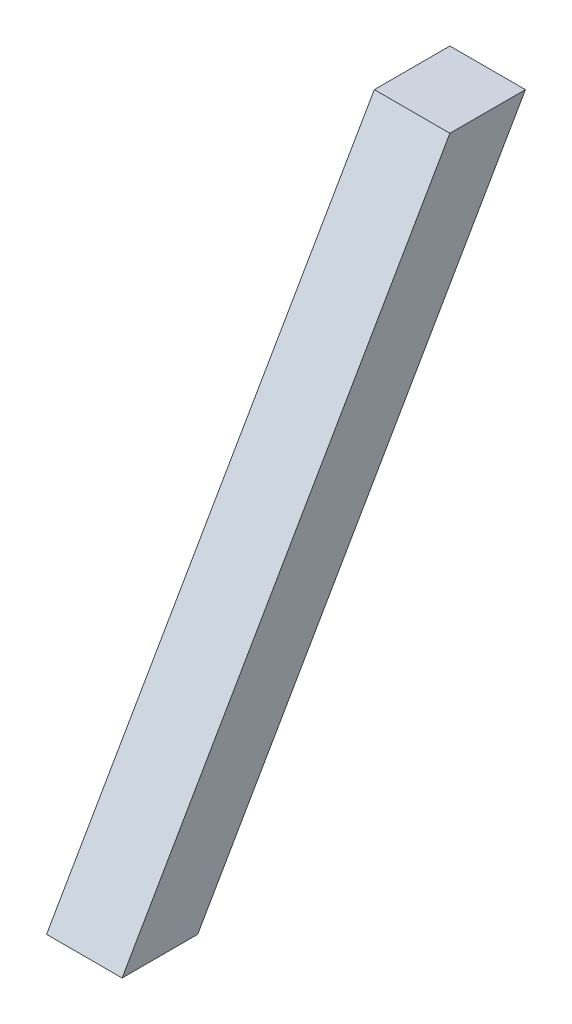
ISO-10303-21;
HEADER;
FILE_DESCRIPTION(('STEP AP214'),'2;1');
FILE_NAME('part.step','',(''),(''),'','','');
FILE_SCHEMA(('AUTOMOTIVE_DESIGN { 1 0 10303 214 1 1 1 1 }'));
ENDSEC;
DATA;
#1=APPLICATION_CONTEXT('core data for automotive mechanical design processes');
#2=APPLICATION_PROTOCOL_DEFINITION('international standard','automotive_design',2000,#1);
#3=PRODUCT_CONTEXT('',#1,'mechanical');
#4=PRODUCT('Part','Part','',(#3));
#5=PRODUCT_RELATED_PRODUCT_CATEGORY('part','',(#4));
#6=PRODUCT_DEFINITION_FORMATION('','',#4);
#7=PRODUCT_DEFINITION_CONTEXT('part definition',#1,'design');
#8=PRODUCT_DEFINITION('design','',#6,#7);
#9=PRODUCT_DEFINITION_SHAPE('','',#8);
#10=(LENGTH_UNIT() NAMED_UNIT(*) SI_UNIT(.MILLI.,.METRE.));
#11=(NAMED_UNIT(*) PLANE_ANGLE_UNIT() SI_UNIT($,.RADIAN.));
#12=(NAMED_UNIT(*) SI_UNIT($,.STERADIAN.) SOLID_ANGLE_UNIT());
#13=UNCERTAINTY_MEASURE_WITH_UNIT(LENGTH_MEASURE(1.E-05),#10,'distance_accuracy_value','');
#14=(GEOMETRIC_REPRESENTATION_CONTEXT(3) GLOBAL_UNCERTAINTY_ASSIGNED_CONTEXT((#13)) GLOBAL_UNIT_ASSIGNED_CONTEXT((#10,
#11,#12)) REPRESENTATION_CONTEXT('',''));
#15=CARTESIAN_POINT('',(0.,0.,0.));
#16=DIRECTION('',(0.,0.,1.));
#17=DIRECTION('',(1.,0.,0.));
#18=AXIS2_PLACEMENT_3D('',#15,#16,#17);
#19=CARTESIAN_POINT('',(40.,300.510815113199,-153.500000000001));
#20=DIRECTION('',(0.,-0.500000000000004,-0.866025403784436));
#21=DIRECTION('',(0.,0.866025403784436,-0.500000000000004));
#22=AXIS2_PLACEMENT_3D('',#19,#20,#21);
#23=PLANE('',#22);
#24=DIRECTION('',(0.,-0.866025403784436,0.500000000000004));
#25=VECTOR('',#24,1.);
#26=CARTESIAN_POINT('',(0.,300.510815113199,-153.500000000001));
#27=LINE('',#26,#25);
#28=CARTESIAN_POINT('',(0.,300.510815113199,-153.500000000001));
#29=VERTEX_POINT('',#28);
#30=CARTESIAN_POINT('',(0.,0.,20.));
#31=VERTEX_POINT('',#30);
#32=EDGE_CURVE('E96',#29,#31,#27,.T.);
#33=ORIENTED_EDGE('',*,*,#32,.T.);
#34=DIRECTION('',(-1.,0.,0.));
#35=VECTOR('',#34,1.);
#36=CARTESIAN_POINT('',(40.,0.,20.));
#37=LINE('',#36,#35);
#38=CARTESIAN_POINT('',(40.,0.,20.));
#39=VERTEX_POINT('',#38);
#40=EDGE_CURVE('E11',#39,#31,#37,.T.);
#41=ORIENTED_EDGE('',*,*,#40,.F.);
#42=DIRECTION('',(0.,-0.866025403784436,0.500000000000004));
#43=VECTOR('',#42,1.);
#44=CARTESIAN_POINT('',(40.,300.510815113199,-153.500000000001));
#45=LINE('',#44,#43);
#46=CARTESIAN_POINT('',(40.,300.510815113199,-153.500000000001));
#47=VERTEX_POINT('',#46);
#48=EDGE_CURVE('E84',#47,#39,#45,.T.);
#49=ORIENTED_EDGE('',*,*,#48,.F.);
#50=DIRECTION('',(-1.,0.,0.));
#51=VECTOR('',#50,1.);
#52=CARTESIAN_POINT('',(40.,300.510815113199,-153.500000000001));
#53=LINE('',#52,#51);
#54=EDGE_CURVE('E92',#47,#29,#53,.T.);
#55=ORIENTED_EDGE('',*,*,#54,.T.);
#56=EDGE_LOOP('',(#33,#41,#49,#55));
#57=FACE_BOUND('',#56,.T.);
#58=ADVANCED_FACE('F33',(#57),#23,.F.);
#59=CARTESIAN_POINT('',(40.,0.,20.));
#60=DIRECTION('',(0.,1.,0.));
#61=DIRECTION('',(0.,0.,1.));
#62=AXIS2_PLACEMENT_3D('',#59,#60,#61);
#63=PLANE('',#62);
#64=DIRECTION('',(0.,0.,-1.));
#65=VECTOR('',#64,1.);
#66=CARTESIAN_POINT('',(0.,0.,20.));
#67=LINE('',#66,#65);
#68=CARTESIAN_POINT('',(0.,0.,-20.));
#69=VERTEX_POINT('',#68);
#70=EDGE_CURVE('E88',#31,#69,#67,.T.);
#71=ORIENTED_EDGE('',*,*,#70,.T.);
#72=DIRECTION('',(-1.,0.,0.));
#73=VECTOR('',#72,1.);
#74=CARTESIAN_POINT('',(40.,0.,-20.));
#75=LINE('',#74,#73);
#76=CARTESIAN_POINT('',(40.,0.,-20.));
#77=VERTEX_POINT('',#76);
#78=EDGE_CURVE('E41',#77,#69,#75,.T.);
#79=ORIENTED_EDGE('',*,*,#78,.F.);
#80=DIRECTION('',(0.,0.,-1.));
#81=VECTOR('',#80,1.);
#82=CARTESIAN_POINT('',(40.,0.,20.));
#83=LINE('',#82,#81);
#84=EDGE_CURVE('E79',#39,#77,#83,.T.);
#85=ORIENTED_EDGE('',*,*,#84,.F.);
#86=ORIENTED_EDGE('',*,*,#40,.T.);
#87=EDGE_LOOP('',(#71,#79,#85,#86));
#88=FACE_BOUND('',#87,.T.);
#89=ADVANCED_FACE('F87',(#88),#63,.F.);
#90=CARTESIAN_POINT('',(40.,0.,-20.));
#91=DIRECTION('',(0.,0.500000000000004,0.866025403784436));
#92=DIRECTION('',(0.,-0.866025403784436,0.500000000000004));
#93=AXIS2_PLACEMENT_3D('',#90,#91,#92);
#94=PLANE('',#93);
#95=DIRECTION('',(0.,0.866025403784436,-0.500000000000004));
#96=VECTOR('',#95,1.);
#97=CARTESIAN_POINT('',(0.,0.,-20.));
#98=LINE('',#97,#96);
#99=CARTESIAN_POINT('',(0.,300.510815113199,-193.500000000001));
#100=VERTEX_POINT('',#99);
#101=EDGE_CURVE('E66',#69,#100,#98,.T.);
#102=ORIENTED_EDGE('',*,*,#101,.T.);
#103=DIRECTION('',(-1.,0.,0.));
#104=VECTOR('',#103,1.);
#105=CARTESIAN_POINT('',(40.,300.510815113199,-193.500000000001));
#106=LINE('',#105,#104);
#107=CARTESIAN_POINT('',(40.,300.510815113199,-193.500000000001));
#108=VERTEX_POINT('',#107);
#109=EDGE_CURVE('E89',#108,#100,#106,.T.);
#110=ORIENTED_EDGE('',*,*,#109,.F.);
#111=DIRECTION('',(0.,0.866025403784436,-0.500000000000004));
#112=VECTOR('',#111,1.);
#113=CARTESIAN_POINT('',(40.,0.,-20.));
#114=LINE('',#113,#112);
#115=EDGE_CURVE('E82',#77,#108,#114,.T.);
#116=ORIENTED_EDGE('',*,*,#115,.F.);
#117=ORIENTED_EDGE('',*,*,#78,.T.);
#118=EDGE_LOOP('',(#102,#110,#116,#117));
#119=FACE_BOUND('',#118,.T.);
#120=ADVANCED_FACE('F90',(#119),#94,.F.);
#121=CARTESIAN_POINT('',(40.,300.510815113199,-193.500000000001));
#122=DIRECTION('',(0.,-1.,0.));
#123=DIRECTION('',(0.,0.,-1.));
#124=AXIS2_PLACEMENT_3D('',#121,#122,#123);
#125=PLANE('',#124);
#126=DIRECTION('',(0.,0.,1.));
#127=VECTOR('',#126,1.);
#128=CARTESIAN_POINT('',(0.,300.510815113199,-193.500000000001));
#129=LINE('',#128,#127);
#130=EDGE_CURVE('E72',#100,#29,#129,.T.);
#131=ORIENTED_EDGE('',*,*,#130,.T.);
#132=ORIENTED_EDGE('',*,*,#54,.F.);
#133=DIRECTION('',(0.,0.,1.));
#134=VECTOR('',#133,1.);
#135=CARTESIAN_POINT('',(40.,300.510815113199,-193.500000000001));
#136=LINE('',#135,#134);
#137=EDGE_CURVE('E49',#108,#47,#136,.T.);
#138=ORIENTED_EDGE('',*,*,#137,.F.);
#139=ORIENTED_EDGE('',*,*,#109,.T.);
#140=EDGE_LOOP('',(#131,#132,#138,#139));
#141=FACE_BOUND('',#140,.T.);
#142=ADVANCED_FACE('F103',(#141),#125,.F.);
#143=CARTESIAN_POINT('',(40.,0.,0.));
#144=DIRECTION('',(1.,0.,0.));
#145=DIRECTION('',(0.,0.,-1.));
#146=AXIS2_PLACEMENT_3D('',#143,#144,#145);
#147=PLANE('',#146);
#148=ORIENTED_EDGE('',*,*,#48,.T.);
#149=ORIENTED_EDGE('',*,*,#84,.T.);
#150=ORIENTED_EDGE('',*,*,#115,.T.);
#151=ORIENTED_EDGE('',*,*,#137,.T.);
#152=EDGE_LOOP('',(#148,#149,#150,#151));
#153=FACE_BOUND('',#152,.T.);
#154=ADVANCED_FACE('F80',(#153),#147,.T.);
#155=CARTESIAN_POINT('',(0.,0.,0.));
#156=DIRECTION('',(1.,0.,0.));
#157=DIRECTION('',(0.,0.,-1.));
#158=AXIS2_PLACEMENT_3D('',#155,#156,#157);
#159=PLANE('',#158);
#160=ORIENTED_EDGE('',*,*,#32,.F.);
#161=ORIENTED_EDGE('',*,*,#130,.F.);
#162=ORIENTED_EDGE('',*,*,#101,.F.);
#163=ORIENTED_EDGE('',*,*,#70,.F.);
#164=EDGE_LOOP('',(#160,#161,#162,#163));
#165=FACE_BOUND('',#164,.T.);
#166=ADVANCED_FACE('F106',(#165),#159,.F.);
#167=CLOSED_SHELL('',(#58,#89,#120,#142,#154,#166));
#168=MANIFOLD_SOLID_BREP('B2',#167);
#169=ADVANCED_BREP_SHAPE_REPRESENTATION('',(#18,#168),#14);
#170=SHAPE_DEFINITION_REPRESENTATION(#9,#169);
ENDSEC;
END-ISO-10303-21;
